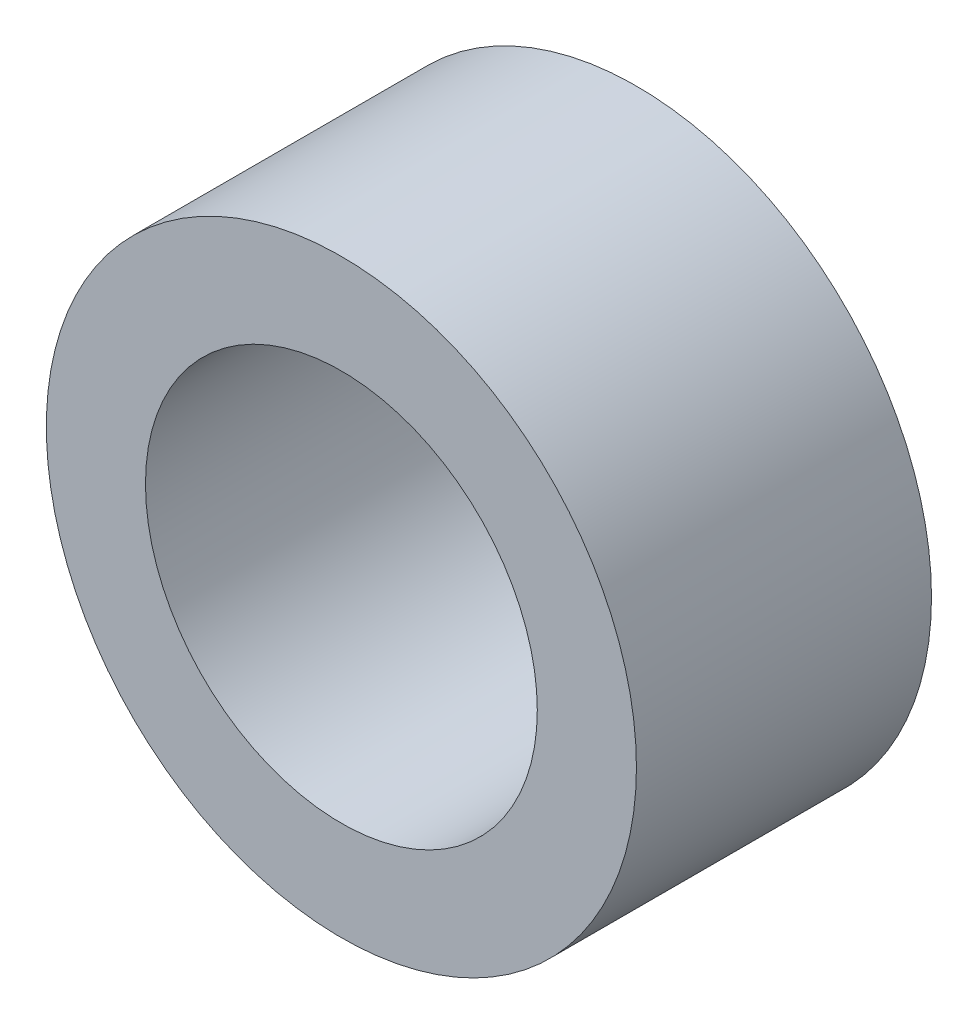
ISO-10303-21;
HEADER;
FILE_DESCRIPTION(('STEP AP214'),'2;1');
FILE_NAME('part.step','',(''),(''),'','','');
FILE_SCHEMA(('AUTOMOTIVE_DESIGN { 1 0 10303 214 1 1 1 1 }'));
ENDSEC;
DATA;
#1=APPLICATION_CONTEXT('core data for automotive mechanical design processes');
#2=APPLICATION_PROTOCOL_DEFINITION('international standard','automotive_design',2000,#1);
#3=PRODUCT_CONTEXT('',#1,'mechanical');
#4=PRODUCT('Part','Part','',(#3));
#5=PRODUCT_RELATED_PRODUCT_CATEGORY('part','',(#4));
#6=PRODUCT_DEFINITION_FORMATION('','',#4);
#7=PRODUCT_DEFINITION_CONTEXT('part definition',#1,'design');
#8=PRODUCT_DEFINITION('design','',#6,#7);
#9=PRODUCT_DEFINITION_SHAPE('','',#8);
#10=(LENGTH_UNIT() NAMED_UNIT(*) SI_UNIT(.MILLI.,.METRE.));
#11=(NAMED_UNIT(*) PLANE_ANGLE_UNIT() SI_UNIT($,.RADIAN.));
#12=(NAMED_UNIT(*) SI_UNIT($,.STERADIAN.) SOLID_ANGLE_UNIT());
#13=UNCERTAINTY_MEASURE_WITH_UNIT(LENGTH_MEASURE(1.E-05),#10,'distance_accuracy_value','');
#14=(GEOMETRIC_REPRESENTATION_CONTEXT(3) GLOBAL_UNCERTAINTY_ASSIGNED_CONTEXT((#13)) GLOBAL_UNIT_ASSIGNED_CONTEXT((#10,
#11,#12)) REPRESENTATION_CONTEXT('',''));
#15=CARTESIAN_POINT('',(0.,0.,0.));
#16=DIRECTION('',(0.,0.,1.));
#17=DIRECTION('',(1.,0.,0.));
#18=AXIS2_PLACEMENT_3D('',#15,#16,#17);
#19=CARTESIAN_POINT('',(0.,0.,1.5875));
#20=DIRECTION('',(0.,0.,1.));
#21=DIRECTION('',(1.,0.,0.));
#22=AXIS2_PLACEMENT_3D('',#19,#20,#21);
#23=PLANE('',#22);
#24=CARTESIAN_POINT('',(0.,0.,1.5875));
#25=DIRECTION('',(0.,0.,1.));
#26=DIRECTION('',(1.,0.,0.));
#27=AXIS2_PLACEMENT_3D('',#24,#25,#26);
#28=CIRCLE('',#27,3.175);
#29=CARTESIAN_POINT('',(3.175,0.,1.5875));
#30=VERTEX_POINT('',#29);
#31=EDGE_CURVE('E10',#30,#30,#28,.T.);
#32=ORIENTED_EDGE('',*,*,#31,.T.);
#33=EDGE_LOOP('',(#32));
#34=FACE_BOUND('',#33,.T.);
#35=CARTESIAN_POINT('',(0.,0.,1.5875));
#36=DIRECTION('',(0.,0.,1.));
#37=DIRECTION('',(1.,0.,0.));
#38=AXIS2_PLACEMENT_3D('',#35,#36,#37);
#39=CIRCLE('',#38,2.1082);
#40=CARTESIAN_POINT('',(2.1082,0.,1.5875));
#41=VERTEX_POINT('',#40);
#42=EDGE_CURVE('E50',#41,#41,#39,.T.);
#43=ORIENTED_EDGE('',*,*,#42,.F.);
#44=EDGE_LOOP('',(#43));
#45=FACE_BOUND('',#44,.T.);
#46=ADVANCED_FACE('F36',(#34,#45),#23,.T.);
#47=CARTESIAN_POINT('',(0.,0.,-1.5875));
#48=DIRECTION('',(0.,0.,1.));
#49=DIRECTION('',(1.,0.,0.));
#50=AXIS2_PLACEMENT_3D('',#47,#48,#49);
#51=PLANE('',#50);
#52=CARTESIAN_POINT('',(0.,0.,-1.5875));
#53=DIRECTION('',(0.,0.,1.));
#54=DIRECTION('',(1.,0.,0.));
#55=AXIS2_PLACEMENT_3D('',#52,#53,#54);
#56=CIRCLE('',#55,3.175);
#57=CARTESIAN_POINT('',(3.175,0.,-1.5875));
#58=VERTEX_POINT('',#57);
#59=EDGE_CURVE('E40',#58,#58,#56,.T.);
#60=ORIENTED_EDGE('',*,*,#59,.F.);
#61=EDGE_LOOP('',(#60));
#62=FACE_BOUND('',#61,.T.);
#63=CARTESIAN_POINT('',(0.,0.,-1.5875));
#64=DIRECTION('',(0.,0.,1.));
#65=DIRECTION('',(1.,0.,0.));
#66=AXIS2_PLACEMENT_3D('',#63,#64,#65);
#67=CIRCLE('',#66,2.1082);
#68=CARTESIAN_POINT('',(2.1082,0.,-1.5875));
#69=VERTEX_POINT('',#68);
#70=EDGE_CURVE('E52',#69,#69,#67,.T.);
#71=ORIENTED_EDGE('',*,*,#70,.T.);
#72=EDGE_LOOP('',(#71));
#73=FACE_BOUND('',#72,.T.);
#74=ADVANCED_FACE('F63',(#62,#73),#51,.F.);
#75=CARTESIAN_POINT('',(0.,0.,1.5875));
#76=DIRECTION('',(0.,0.,-1.));
#77=DIRECTION('',(-1.,0.,0.));
#78=AXIS2_PLACEMENT_3D('',#75,#76,#77);
#79=CYLINDRICAL_SURFACE('',#78,3.175);
#80=ORIENTED_EDGE('',*,*,#31,.F.);
#81=EDGE_LOOP('',(#80));
#82=FACE_BOUND('',#81,.T.);
#83=ORIENTED_EDGE('',*,*,#59,.T.);
#84=EDGE_LOOP('',(#83));
#85=FACE_BOUND('',#84,.T.);
#86=ADVANCED_FACE('F38',(#82,#85),#79,.T.);
#87=CARTESIAN_POINT('',(0.,0.,1.5875));
#88=DIRECTION('',(0.,0.,-1.));
#89=DIRECTION('',(-1.,0.,0.));
#90=AXIS2_PLACEMENT_3D('',#87,#88,#89);
#91=CYLINDRICAL_SURFACE('',#90,2.1082);
#92=ORIENTED_EDGE('',*,*,#42,.T.);
#93=EDGE_LOOP('',(#92));
#94=FACE_BOUND('',#93,.T.);
#95=ORIENTED_EDGE('',*,*,#70,.F.);
#96=EDGE_LOOP('',(#95));
#97=FACE_BOUND('',#96,.T.);
#98=ADVANCED_FACE('F59',(#94,#97),#91,.F.);
#99=CLOSED_SHELL('',(#46,#74,#86,#98));
#100=MANIFOLD_SOLID_BREP('B2',#99);
#101=ADVANCED_BREP_SHAPE_REPRESENTATION('',(#18,#100),#14);
#102=SHAPE_DEFINITION_REPRESENTATION(#9,#101);
ENDSEC;
END-ISO-10303-21;
